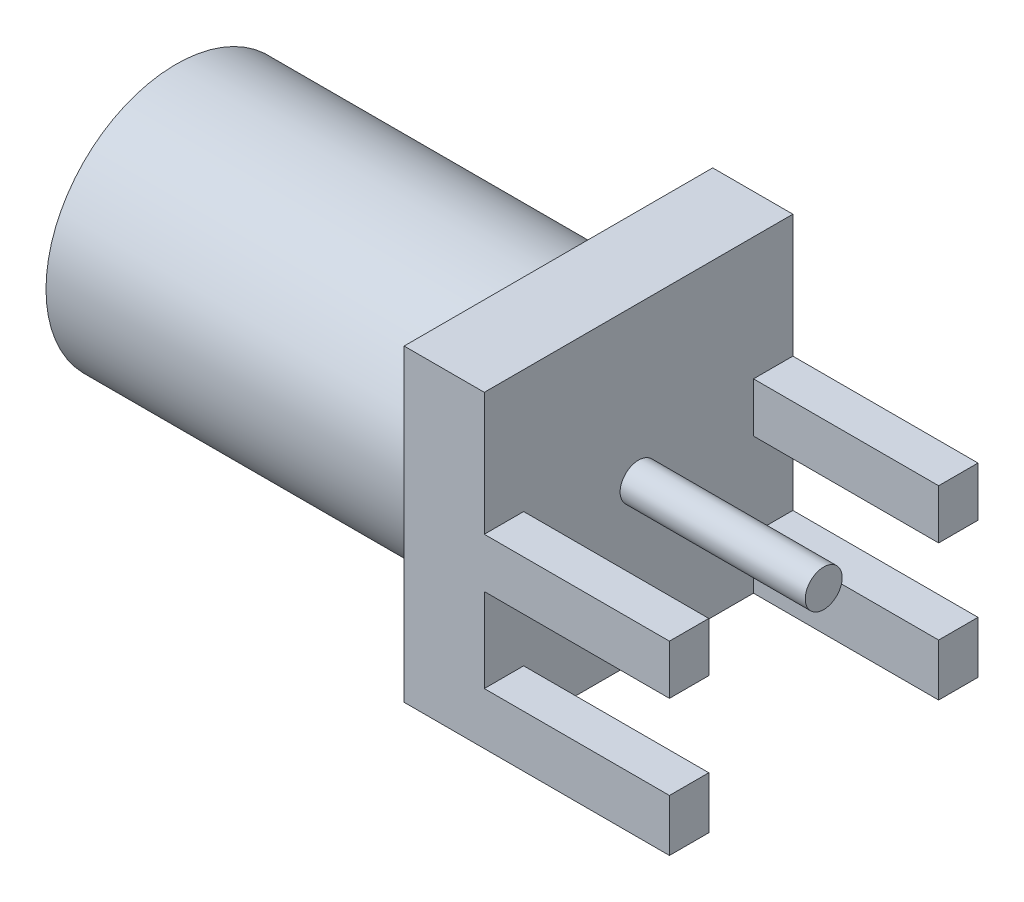
ISO-10303-21;
HEADER;
FILE_DESCRIPTION(('STEP AP214'),'2;1');
FILE_NAME('part.step','',(''),(''),'','','');
FILE_SCHEMA(('AUTOMOTIVE_DESIGN { 1 0 10303 214 1 1 1 1 }'));
ENDSEC;
DATA;
#1=APPLICATION_CONTEXT('core data for automotive mechanical design processes');
#2=APPLICATION_PROTOCOL_DEFINITION('international standard','automotive_design',2000,#1);
#3=PRODUCT_CONTEXT('',#1,'mechanical');
#4=PRODUCT('Part','Part','',(#3));
#5=PRODUCT_RELATED_PRODUCT_CATEGORY('part','',(#4));
#6=PRODUCT_DEFINITION_FORMATION('','',#4);
#7=PRODUCT_DEFINITION_CONTEXT('part definition',#1,'design');
#8=PRODUCT_DEFINITION('design','',#6,#7);
#9=PRODUCT_DEFINITION_SHAPE('','',#8);
#10=(LENGTH_UNIT() NAMED_UNIT(*) SI_UNIT(.MILLI.,.METRE.));
#11=(NAMED_UNIT(*) PLANE_ANGLE_UNIT() SI_UNIT($,.RADIAN.));
#12=(NAMED_UNIT(*) SI_UNIT($,.STERADIAN.) SOLID_ANGLE_UNIT());
#13=UNCERTAINTY_MEASURE_WITH_UNIT(LENGTH_MEASURE(1.E-05),#10,'distance_accuracy_value','');
#14=(GEOMETRIC_REPRESENTATION_CONTEXT(3) GLOBAL_UNCERTAINTY_ASSIGNED_CONTEXT((#13)) GLOBAL_UNIT_ASSIGNED_CONTEXT((#10,
#11,#12)) REPRESENTATION_CONTEXT('',''));
#15=CARTESIAN_POINT('',(0.,0.,0.));
#16=DIRECTION('',(0.,0.,1.));
#17=DIRECTION('',(1.,0.,0.));
#18=AXIS2_PLACEMENT_3D('',#15,#16,#17);
#19=CARTESIAN_POINT('',(-1.65,0.,0.));
#20=DIRECTION('',(-1.,0.,0.));
#21=DIRECTION('',(0.,0.,1.));
#22=AXIS2_PLACEMENT_3D('',#19,#20,#21);
#23=PLANE('',#22);
#24=DIRECTION('',(0.,1.,0.));
#25=VECTOR('',#24,1.);
#26=CARTESIAN_POINT('',(-1.65,-3.175,-3.175));
#27=LINE('',#26,#25);
#28=CARTESIAN_POINT('',(-1.65,-3.175,-3.175));
#29=VERTEX_POINT('',#28);
#30=CARTESIAN_POINT('',(-1.65,3.175,-3.175));
#31=VERTEX_POINT('',#30);
#32=EDGE_CURVE('E273',#29,#31,#27,.T.);
#33=ORIENTED_EDGE('',*,*,#32,.F.);
#34=DIRECTION('',(0.,0.,-1.));
#35=VECTOR('',#34,1.);
#36=CARTESIAN_POINT('',(-1.65,-3.175,3.175));
#37=LINE('',#36,#35);
#38=CARTESIAN_POINT('',(-1.65,-3.175,3.175));
#39=VERTEX_POINT('',#38);
#40=EDGE_CURVE('E296',#39,#29,#37,.T.);
#41=ORIENTED_EDGE('',*,*,#40,.F.);
#42=DIRECTION('',(0.,-1.,0.));
#43=VECTOR('',#42,1.);
#44=CARTESIAN_POINT('',(-1.65,-3.175,3.175));
#45=LINE('',#44,#43);
#46=CARTESIAN_POINT('',(-1.65,3.175,3.175));
#47=VERTEX_POINT('',#46);
#48=EDGE_CURVE('E370',#47,#39,#45,.T.);
#49=ORIENTED_EDGE('',*,*,#48,.F.);
#50=DIRECTION('',(0.,0.,1.));
#51=VECTOR('',#50,1.);
#52=CARTESIAN_POINT('',(-1.65,3.175,3.175));
#53=LINE('',#52,#51);
#54=EDGE_CURVE('E372',#31,#47,#53,.T.);
#55=ORIENTED_EDGE('',*,*,#54,.F.);
#56=EDGE_LOOP('',(#33,#41,#49,#55));
#57=FACE_BOUND('',#56,.T.);
#58=CARTESIAN_POINT('',(-1.65,0.,0.));
#59=DIRECTION('',(-1.,0.,0.));
#60=DIRECTION('',(0.,0.,1.));
#61=AXIS2_PLACEMENT_3D('',#58,#59,#60);
#62=CIRCLE('',#61,2.675);
#63=CARTESIAN_POINT('',(-1.65,0.,2.675));
#64=VERTEX_POINT('',#63);
#65=EDGE_CURVE('E551',#64,#64,#62,.T.);
#66=ORIENTED_EDGE('',*,*,#65,.F.);
#67=EDGE_LOOP('',(#66));
#68=FACE_BOUND('',#67,.T.);
#69=ADVANCED_FACE('F37',(#57,#68),#23,.T.);
#70=CARTESIAN_POINT('',(0.,0.,0.));
#71=DIRECTION('',(-1.,0.,0.));
#72=DIRECTION('',(0.,0.,1.));
#73=AXIS2_PLACEMENT_3D('',#70,#71,#72);
#74=PLANE('',#73);
#75=DIRECTION('',(0.,0.,1.));
#76=VECTOR('',#75,1.);
#77=CARTESIAN_POINT('',(0.,0.644999999999998,2.365));
#78=LINE('',#77,#76);
#79=CARTESIAN_POINT('',(0.,0.644999999999998,2.365));
#80=VERTEX_POINT('',#79);
#81=CARTESIAN_POINT('',(0.,0.644999999999998,3.175));
#82=VERTEX_POINT('',#81);
#83=EDGE_CURVE('E57',#80,#82,#78,.T.);
#84=ORIENTED_EDGE('',*,*,#83,.F.);
#85=DIRECTION('',(0.,1.,0.));
#86=VECTOR('',#85,1.);
#87=CARTESIAN_POINT('',(0.,0.644999999999998,2.365));
#88=LINE('',#87,#86);
#89=CARTESIAN_POINT('',(0.,-0.375000000000002,2.365));
#90=VERTEX_POINT('',#89);
#91=EDGE_CURVE('E52',#90,#80,#88,.T.);
#92=ORIENTED_EDGE('',*,*,#91,.F.);
#93=DIRECTION('',(0.,0.,1.));
#94=VECTOR('',#93,1.);
#95=CARTESIAN_POINT('',(0.,-0.375000000000002,2.365));
#96=LINE('',#95,#94);
#97=CARTESIAN_POINT('',(0.,-0.375000000000002,3.175));
#98=VERTEX_POINT('',#97);
#99=EDGE_CURVE('E181',#90,#98,#96,.T.);
#100=ORIENTED_EDGE('',*,*,#99,.T.);
#101=DIRECTION('',(0.,-1.,0.));
#102=VECTOR('',#101,1.);
#103=CARTESIAN_POINT('',(0.,-3.175,3.175));
#104=LINE('',#103,#102);
#105=CARTESIAN_POINT('',(0.,-2.105,3.175));
#106=VERTEX_POINT('',#105);
#107=EDGE_CURVE('E360',#98,#106,#104,.T.);
#108=ORIENTED_EDGE('',*,*,#107,.T.);
#109=DIRECTION('',(0.,0.,1.));
#110=VECTOR('',#109,1.);
#111=CARTESIAN_POINT('',(0.,-2.105,2.365));
#112=LINE('',#111,#110);
#113=CARTESIAN_POINT('',(0.,-2.105,2.365));
#114=VERTEX_POINT('',#113);
#115=EDGE_CURVE('E214',#114,#106,#112,.T.);
#116=ORIENTED_EDGE('',*,*,#115,.F.);
#117=DIRECTION('',(0.,1.,0.));
#118=VECTOR('',#117,1.);
#119=CARTESIAN_POINT('',(0.,-2.105,2.365));
#120=LINE('',#119,#118);
#121=CARTESIAN_POINT('',(0.,-3.175,2.365));
#122=VERTEX_POINT('',#121);
#123=EDGE_CURVE('E199',#122,#114,#120,.T.);
#124=ORIENTED_EDGE('',*,*,#123,.F.);
#125=DIRECTION('',(0.,0.,-1.));
#126=VECTOR('',#125,1.);
#127=CARTESIAN_POINT('',(0.,-3.175,3.175));
#128=LINE('',#127,#126);
#129=CARTESIAN_POINT('',(0.,-3.175,-2.365));
#130=VERTEX_POINT('',#129);
#131=EDGE_CURVE('E291',#122,#130,#128,.T.);
#132=ORIENTED_EDGE('',*,*,#131,.T.);
#133=DIRECTION('',(0.,1.,0.));
#134=VECTOR('',#133,1.);
#135=CARTESIAN_POINT('',(0.,-2.105,-2.365));
#136=LINE('',#135,#134);
#137=CARTESIAN_POINT('',(0.,-2.105,-2.365));
#138=VERTEX_POINT('',#137);
#139=EDGE_CURVE('E257',#130,#138,#136,.T.);
#140=ORIENTED_EDGE('',*,*,#139,.T.);
#141=DIRECTION('',(0.,0.,-1.));
#142=VECTOR('',#141,1.);
#143=CARTESIAN_POINT('',(0.,-2.105,-2.365));
#144=LINE('',#143,#142);
#145=CARTESIAN_POINT('',(0.,-2.105,-3.175));
#146=VERTEX_POINT('',#145);
#147=EDGE_CURVE('E270',#138,#146,#144,.T.);
#148=ORIENTED_EDGE('',*,*,#147,.T.);
#149=DIRECTION('',(0.,1.,0.));
#150=VECTOR('',#149,1.);
#151=CARTESIAN_POINT('',(0.,-3.175,-3.175));
#152=LINE('',#151,#150);
#153=CARTESIAN_POINT('',(0.,-0.375000000000002,-3.175));
#154=VERTEX_POINT('',#153);
#155=EDGE_CURVE('E290',#146,#154,#152,.T.);
#156=ORIENTED_EDGE('',*,*,#155,.T.);
#157=DIRECTION('',(0.,0.,-1.));
#158=VECTOR('',#157,1.);
#159=CARTESIAN_POINT('',(0.,-0.375000000000002,-2.365));
#160=LINE('',#159,#158);
#161=CARTESIAN_POINT('',(0.,-0.375000000000002,-2.365));
#162=VERTEX_POINT('',#161);
#163=EDGE_CURVE('E243',#162,#154,#160,.T.);
#164=ORIENTED_EDGE('',*,*,#163,.F.);
#165=DIRECTION('',(0.,1.,0.));
#166=VECTOR('',#165,1.);
#167=CARTESIAN_POINT('',(0.,0.644999999999998,-2.365));
#168=LINE('',#167,#166);
#169=CARTESIAN_POINT('',(0.,0.644999999999998,-2.365));
#170=VERTEX_POINT('',#169);
#171=EDGE_CURVE('E223',#162,#170,#168,.T.);
#172=ORIENTED_EDGE('',*,*,#171,.T.);
#173=DIRECTION('',(0.,0.,-1.));
#174=VECTOR('',#173,1.);
#175=CARTESIAN_POINT('',(0.,0.644999999999998,-2.365));
#176=LINE('',#175,#174);
#177=CARTESIAN_POINT('',(0.,0.644999999999998,-3.175));
#178=VERTEX_POINT('',#177);
#179=EDGE_CURVE('E235',#170,#178,#176,.T.);
#180=ORIENTED_EDGE('',*,*,#179,.T.);
#181=CARTESIAN_POINT('',(0.,3.175,-3.175));
#182=VERTEX_POINT('',#181);
#183=EDGE_CURVE('E267',#178,#182,#152,.T.);
#184=ORIENTED_EDGE('',*,*,#183,.T.);
#185=DIRECTION('',(0.,0.,1.));
#186=VECTOR('',#185,1.);
#187=CARTESIAN_POINT('',(0.,3.175,3.175));
#188=LINE('',#187,#186);
#189=CARTESIAN_POINT('',(0.,3.175,3.175));
#190=VERTEX_POINT('',#189);
#191=EDGE_CURVE('E298',#182,#190,#188,.T.);
#192=ORIENTED_EDGE('',*,*,#191,.T.);
#193=EDGE_CURVE('E355',#190,#82,#104,.T.);
#194=ORIENTED_EDGE('',*,*,#193,.T.);
#195=EDGE_LOOP('',(#84,#92,#100,#108,#116,#124,#132,#140,#148,#156,#164,#172,#180,#184,#192,#194));
#196=FACE_BOUND('',#195,.T.);
#197=CARTESIAN_POINT('',(0.,0.,0.));
#198=DIRECTION('',(-1.,0.,0.));
#199=DIRECTION('',(0.,0.,1.));
#200=AXIS2_PLACEMENT_3D('',#197,#198,#199);
#201=CIRCLE('',#200,0.38);
#202=CARTESIAN_POINT('',(0.,0.,0.38));
#203=VERTEX_POINT('',#202);
#204=EDGE_CURVE('E12',#203,#203,#201,.F.);
#205=ORIENTED_EDGE('',*,*,#204,.F.);
#206=EDGE_LOOP('',(#205));
#207=FACE_BOUND('',#206,.T.);
#208=ADVANCED_FACE('F312',(#196,#207),#74,.F.);
#209=CARTESIAN_POINT('',(-1.65,-3.175,-3.175));
#210=DIRECTION('',(0.,0.,-1.));
#211=DIRECTION('',(-1.,0.,0.));
#212=AXIS2_PLACEMENT_3D('',#209,#210,#211);
#213=PLANE('',#212);
#214=ORIENTED_EDGE('',*,*,#155,.F.);
#215=DIRECTION('',(1.,0.,0.));
#216=VECTOR('',#215,1.);
#217=CARTESIAN_POINT('',(3.81,-2.105,-3.175));
#218=LINE('',#217,#216);
#219=CARTESIAN_POINT('',(3.81,-2.105,-3.175));
#220=VERTEX_POINT('',#219);
#221=EDGE_CURVE('E246',#146,#220,#218,.T.);
#222=ORIENTED_EDGE('',*,*,#221,.T.);
#223=DIRECTION('',(0.,-1.,0.));
#224=VECTOR('',#223,1.);
#225=CARTESIAN_POINT('',(3.81,-3.175,-3.175));
#226=LINE('',#225,#224);
#227=CARTESIAN_POINT('',(3.81,-3.175,-3.175));
#228=VERTEX_POINT('',#227);
#229=EDGE_CURVE('E261',#220,#228,#226,.T.);
#230=ORIENTED_EDGE('',*,*,#229,.T.);
#231=DIRECTION('',(1.,0.,0.));
#232=VECTOR('',#231,1.);
#233=CARTESIAN_POINT('',(-1.65,-3.175,-3.175));
#234=LINE('',#233,#232);
#235=EDGE_CURVE('E45',#29,#228,#234,.T.);
#236=ORIENTED_EDGE('',*,*,#235,.F.);
#237=ORIENTED_EDGE('',*,*,#32,.T.);
#238=DIRECTION('',(1.,0.,0.));
#239=VECTOR('',#238,1.);
#240=CARTESIAN_POINT('',(-1.65,3.175,-3.175));
#241=LINE('',#240,#239);
#242=EDGE_CURVE('E303',#31,#182,#241,.T.);
#243=ORIENTED_EDGE('',*,*,#242,.T.);
#244=ORIENTED_EDGE('',*,*,#183,.F.);
#245=DIRECTION('',(1.,0.,0.));
#246=VECTOR('',#245,1.);
#247=CARTESIAN_POINT('',(3.81,0.644999999999998,-3.175));
#248=LINE('',#247,#246);
#249=CARTESIAN_POINT('',(3.81,0.644999999999998,-3.175));
#250=VERTEX_POINT('',#249);
#251=EDGE_CURVE('E217',#178,#250,#248,.T.);
#252=ORIENTED_EDGE('',*,*,#251,.T.);
#253=DIRECTION('',(0.,-1.,0.));
#254=VECTOR('',#253,1.);
#255=CARTESIAN_POINT('',(3.81,-0.375000000000002,-3.175));
#256=LINE('',#255,#254);
#257=CARTESIAN_POINT('',(3.81,-0.375000000000002,-3.175));
#258=VERTEX_POINT('',#257);
#259=EDGE_CURVE('E238',#250,#258,#256,.T.);
#260=ORIENTED_EDGE('',*,*,#259,.T.);
#261=DIRECTION('',(-1.,0.,0.));
#262=VECTOR('',#261,1.);
#263=CARTESIAN_POINT('',(0.,-0.375000000000002,-3.175));
#264=LINE('',#263,#262);
#265=EDGE_CURVE('E226',#258,#154,#264,.T.);
#266=ORIENTED_EDGE('',*,*,#265,.T.);
#267=EDGE_LOOP('',(#214,#222,#230,#236,#237,#243,#244,#252,#260,#266));
#268=FACE_BOUND('',#267,.T.);
#269=ADVANCED_FACE('F39',(#268),#213,.T.);
#270=CARTESIAN_POINT('',(-1.65,-3.175,3.175));
#271=DIRECTION('',(0.,-1.,0.));
#272=DIRECTION('',(0.,0.,-1.));
#273=AXIS2_PLACEMENT_3D('',#270,#271,#272);
#274=PLANE('',#273);
#275=ORIENTED_EDGE('',*,*,#131,.F.);
#276=DIRECTION('',(-1.,0.,0.));
#277=VECTOR('',#276,1.);
#278=CARTESIAN_POINT('',(0.,-3.175,2.365));
#279=LINE('',#278,#277);
#280=CARTESIAN_POINT('',(3.81,-3.175,2.365));
#281=VERTEX_POINT('',#280);
#282=EDGE_CURVE('E202',#281,#122,#279,.T.);
#283=ORIENTED_EDGE('',*,*,#282,.F.);
#284=DIRECTION('',(0.,0.,1.));
#285=VECTOR('',#284,1.);
#286=CARTESIAN_POINT('',(3.81,-3.175,2.365));
#287=LINE('',#286,#285);
#288=CARTESIAN_POINT('',(3.81,-3.175,3.175));
#289=VERTEX_POINT('',#288);
#290=EDGE_CURVE('E210',#281,#289,#287,.T.);
#291=ORIENTED_EDGE('',*,*,#290,.T.);
#292=DIRECTION('',(1.,0.,0.));
#293=VECTOR('',#292,1.);
#294=CARTESIAN_POINT('',(-1.65,-3.175,3.175));
#295=LINE('',#294,#293);
#296=EDGE_CURVE('E367',#39,#289,#295,.T.);
#297=ORIENTED_EDGE('',*,*,#296,.F.);
#298=ORIENTED_EDGE('',*,*,#40,.T.);
#299=ORIENTED_EDGE('',*,*,#235,.T.);
#300=DIRECTION('',(0.,0.,-1.));
#301=VECTOR('',#300,1.);
#302=CARTESIAN_POINT('',(3.81,-3.175,-2.365));
#303=LINE('',#302,#301);
#304=CARTESIAN_POINT('',(3.81,-3.175,-2.365));
#305=VERTEX_POINT('',#304);
#306=EDGE_CURVE('E264',#305,#228,#303,.T.);
#307=ORIENTED_EDGE('',*,*,#306,.F.);
#308=DIRECTION('',(-1.,0.,0.));
#309=VECTOR('',#308,1.);
#310=CARTESIAN_POINT('',(0.,-3.175,-2.365));
#311=LINE('',#310,#309);
#312=EDGE_CURVE('E260',#305,#130,#311,.T.);
#313=ORIENTED_EDGE('',*,*,#312,.T.);
#314=EDGE_LOOP('',(#275,#283,#291,#297,#298,#299,#307,#313));
#315=FACE_BOUND('',#314,.T.);
#316=ADVANCED_FACE('F321',(#315),#274,.T.);
#317=CARTESIAN_POINT('',(-1.65,-3.175,3.175));
#318=DIRECTION('',(0.,0.,1.));
#319=DIRECTION('',(1.,0.,0.));
#320=AXIS2_PLACEMENT_3D('',#317,#318,#319);
#321=PLANE('',#320);
#322=ORIENTED_EDGE('',*,*,#193,.F.);
#323=DIRECTION('',(1.,0.,0.));
#324=VECTOR('',#323,1.);
#325=CARTESIAN_POINT('',(-1.65,3.175,3.175));
#326=LINE('',#325,#324);
#327=EDGE_CURVE('E358',#47,#190,#326,.T.);
#328=ORIENTED_EDGE('',*,*,#327,.F.);
#329=ORIENTED_EDGE('',*,*,#48,.T.);
#330=ORIENTED_EDGE('',*,*,#296,.T.);
#331=DIRECTION('',(0.,-1.,0.));
#332=VECTOR('',#331,1.);
#333=CARTESIAN_POINT('',(3.81,-3.175,3.175));
#334=LINE('',#333,#332);
#335=CARTESIAN_POINT('',(3.81,-2.105,3.175));
#336=VERTEX_POINT('',#335);
#337=EDGE_CURVE('E196',#336,#289,#334,.T.);
#338=ORIENTED_EDGE('',*,*,#337,.F.);
#339=DIRECTION('',(1.,0.,0.));
#340=VECTOR('',#339,1.);
#341=CARTESIAN_POINT('',(3.81,-2.105,3.175));
#342=LINE('',#341,#340);
#343=EDGE_CURVE('E203',#106,#336,#342,.T.);
#344=ORIENTED_EDGE('',*,*,#343,.F.);
#345=ORIENTED_EDGE('',*,*,#107,.F.);
#346=DIRECTION('',(-1.,0.,0.));
#347=VECTOR('',#346,1.);
#348=CARTESIAN_POINT('',(0.,-0.375000000000002,3.175));
#349=LINE('',#348,#347);
#350=CARTESIAN_POINT('',(3.81,-0.375000000000002,3.175));
#351=VERTEX_POINT('',#350);
#352=EDGE_CURVE('E190',#351,#98,#349,.T.);
#353=ORIENTED_EDGE('',*,*,#352,.F.);
#354=DIRECTION('',(0.,-1.,0.));
#355=VECTOR('',#354,1.);
#356=CARTESIAN_POINT('',(3.81,-0.375000000000002,3.175));
#357=LINE('',#356,#355);
#358=CARTESIAN_POINT('',(3.81,0.644999999999998,3.175));
#359=VERTEX_POINT('',#358);
#360=EDGE_CURVE('E176',#359,#351,#357,.T.);
#361=ORIENTED_EDGE('',*,*,#360,.F.);
#362=DIRECTION('',(1.,0.,0.));
#363=VECTOR('',#362,1.);
#364=CARTESIAN_POINT('',(3.81,0.644999999999998,3.175));
#365=LINE('',#364,#363);
#366=EDGE_CURVE('E185',#82,#359,#365,.T.);
#367=ORIENTED_EDGE('',*,*,#366,.F.);
#368=EDGE_LOOP('',(#322,#328,#329,#330,#338,#344,#345,#353,#361,#367));
#369=FACE_BOUND('',#368,.T.);
#370=ADVANCED_FACE('F334',(#369),#321,.T.);
#371=CARTESIAN_POINT('',(-1.65,3.175,3.175));
#372=DIRECTION('',(0.,1.,0.));
#373=DIRECTION('',(0.,0.,1.));
#374=AXIS2_PLACEMENT_3D('',#371,#372,#373);
#375=PLANE('',#374);
#376=ORIENTED_EDGE('',*,*,#191,.F.);
#377=ORIENTED_EDGE('',*,*,#242,.F.);
#378=ORIENTED_EDGE('',*,*,#54,.T.);
#379=ORIENTED_EDGE('',*,*,#327,.T.);
#380=EDGE_LOOP('',(#376,#377,#378,#379));
#381=FACE_BOUND('',#380,.T.);
#382=ADVANCED_FACE('F327',(#381),#375,.T.);
#383=CARTESIAN_POINT('',(3.81,-3.175,-2.365));
#384=DIRECTION('',(1.,0.,0.));
#385=DIRECTION('',(0.,0.,-1.));
#386=AXIS2_PLACEMENT_3D('',#383,#384,#385);
#387=PLANE('',#386);
#388=ORIENTED_EDGE('',*,*,#229,.F.);
#389=DIRECTION('',(0.,0.,-1.));
#390=VECTOR('',#389,1.);
#391=CARTESIAN_POINT('',(3.81,-2.105,-2.365));
#392=LINE('',#391,#390);
#393=CARTESIAN_POINT('',(3.81,-2.105,-2.365));
#394=VERTEX_POINT('',#393);
#395=EDGE_CURVE('E268',#394,#220,#392,.T.);
#396=ORIENTED_EDGE('',*,*,#395,.F.);
#397=DIRECTION('',(0.,-1.,0.));
#398=VECTOR('',#397,1.);
#399=CARTESIAN_POINT('',(3.81,-3.175,-2.365));
#400=LINE('',#399,#398);
#401=EDGE_CURVE('E256',#394,#305,#400,.T.);
#402=ORIENTED_EDGE('',*,*,#401,.T.);
#403=ORIENTED_EDGE('',*,*,#306,.T.);
#404=EDGE_LOOP('',(#388,#396,#402,#403));
#405=FACE_BOUND('',#404,.T.);
#406=ADVANCED_FACE('F325',(#405),#387,.T.);
#407=CARTESIAN_POINT('',(3.81,-2.105,-2.365));
#408=DIRECTION('',(0.,1.,0.));
#409=DIRECTION('',(0.,0.,1.));
#410=AXIS2_PLACEMENT_3D('',#407,#408,#409);
#411=PLANE('',#410);
#412=ORIENTED_EDGE('',*,*,#221,.F.);
#413=ORIENTED_EDGE('',*,*,#147,.F.);
#414=DIRECTION('',(1.,0.,0.));
#415=VECTOR('',#414,1.);
#416=CARTESIAN_POINT('',(3.81,-2.105,-2.365));
#417=LINE('',#416,#415);
#418=EDGE_CURVE('E253',#138,#394,#417,.T.);
#419=ORIENTED_EDGE('',*,*,#418,.T.);
#420=ORIENTED_EDGE('',*,*,#395,.T.);
#421=EDGE_LOOP('',(#412,#413,#419,#420));
#422=FACE_BOUND('',#421,.T.);
#423=ADVANCED_FACE('F310',(#422),#411,.T.);
#424=CARTESIAN_POINT('',(0.,0.,-2.365));
#425=DIRECTION('',(0.,0.,1.));
#426=DIRECTION('',(1.,0.,0.));
#427=AXIS2_PLACEMENT_3D('',#424,#425,#426);
#428=PLANE('',#427);
#429=ORIENTED_EDGE('',*,*,#139,.F.);
#430=ORIENTED_EDGE('',*,*,#312,.F.);
#431=ORIENTED_EDGE('',*,*,#401,.F.);
#432=ORIENTED_EDGE('',*,*,#418,.F.);
#433=EDGE_LOOP('',(#429,#430,#431,#432));
#434=FACE_BOUND('',#433,.T.);
#435=ADVANCED_FACE('F318',(#434),#428,.T.);
#436=CARTESIAN_POINT('',(0.,-0.375000000000002,-2.365));
#437=DIRECTION('',(0.,-1.,0.));
#438=DIRECTION('',(1.,0.,0.));
#439=AXIS2_PLACEMENT_3D('',#436,#437,#438);
#440=PLANE('',#439);
#441=ORIENTED_EDGE('',*,*,#265,.F.);
#442=DIRECTION('',(0.,0.,-1.));
#443=VECTOR('',#442,1.);
#444=CARTESIAN_POINT('',(3.81,-0.375000000000002,-2.365));
#445=LINE('',#444,#443);
#446=CARTESIAN_POINT('',(3.81,-0.375000000000002,-2.365));
#447=VERTEX_POINT('',#446);
#448=EDGE_CURVE('E247',#447,#258,#445,.T.);
#449=ORIENTED_EDGE('',*,*,#448,.F.);
#450=DIRECTION('',(-1.,0.,0.));
#451=VECTOR('',#450,1.);
#452=CARTESIAN_POINT('',(0.,-0.375000000000002,-2.365));
#453=LINE('',#452,#451);
#454=EDGE_CURVE('E232',#447,#162,#453,.T.);
#455=ORIENTED_EDGE('',*,*,#454,.T.);
#456=ORIENTED_EDGE('',*,*,#163,.T.);
#457=EDGE_LOOP('',(#441,#449,#455,#456));
#458=FACE_BOUND('',#457,.T.);
#459=ADVANCED_FACE('F399',(#458),#440,.T.);
#460=CARTESIAN_POINT('',(3.81,-0.375000000000002,-2.365));
#461=DIRECTION('',(1.,0.,0.));
#462=DIRECTION('',(0.,0.,-1.));
#463=AXIS2_PLACEMENT_3D('',#460,#461,#462);
#464=PLANE('',#463);
#465=ORIENTED_EDGE('',*,*,#259,.F.);
#466=DIRECTION('',(0.,0.,-1.));
#467=VECTOR('',#466,1.);
#468=CARTESIAN_POINT('',(3.81,0.644999999999998,-2.365));
#469=LINE('',#468,#467);
#470=CARTESIAN_POINT('',(3.81,0.644999999999998,-2.365));
#471=VERTEX_POINT('',#470);
#472=EDGE_CURVE('E249',#471,#250,#469,.T.);
#473=ORIENTED_EDGE('',*,*,#472,.F.);
#474=DIRECTION('',(0.,-1.,0.));
#475=VECTOR('',#474,1.);
#476=CARTESIAN_POINT('',(3.81,-0.375000000000002,-2.365));
#477=LINE('',#476,#475);
#478=EDGE_CURVE('E229',#471,#447,#477,.T.);
#479=ORIENTED_EDGE('',*,*,#478,.T.);
#480=ORIENTED_EDGE('',*,*,#448,.T.);
#481=EDGE_LOOP('',(#465,#473,#479,#480));
#482=FACE_BOUND('',#481,.T.);
#483=ADVANCED_FACE('F402',(#482),#464,.T.);
#484=CARTESIAN_POINT('',(3.81,0.644999999999998,-2.365));
#485=DIRECTION('',(0.,1.,0.));
#486=DIRECTION('',(-1.,0.,0.));
#487=AXIS2_PLACEMENT_3D('',#484,#485,#486);
#488=PLANE('',#487);
#489=ORIENTED_EDGE('',*,*,#251,.F.);
#490=ORIENTED_EDGE('',*,*,#179,.F.);
#491=DIRECTION('',(1.,0.,0.));
#492=VECTOR('',#491,1.);
#493=CARTESIAN_POINT('',(3.81,0.644999999999998,-2.365));
#494=LINE('',#493,#492);
#495=EDGE_CURVE('E225',#170,#471,#494,.T.);
#496=ORIENTED_EDGE('',*,*,#495,.T.);
#497=ORIENTED_EDGE('',*,*,#472,.T.);
#498=EDGE_LOOP('',(#489,#490,#496,#497));
#499=FACE_BOUND('',#498,.T.);
#500=ADVANCED_FACE('F393',(#499),#488,.T.);
#501=CARTESIAN_POINT('',(0.,0.,-2.365));
#502=DIRECTION('',(0.,0.,1.));
#503=DIRECTION('',(1.,0.,0.));
#504=AXIS2_PLACEMENT_3D('',#501,#502,#503);
#505=PLANE('',#504);
#506=ORIENTED_EDGE('',*,*,#171,.F.);
#507=ORIENTED_EDGE('',*,*,#454,.F.);
#508=ORIENTED_EDGE('',*,*,#478,.F.);
#509=ORIENTED_EDGE('',*,*,#495,.F.);
#510=EDGE_LOOP('',(#506,#507,#508,#509));
#511=FACE_BOUND('',#510,.T.);
#512=ADVANCED_FACE('F386',(#511),#505,.T.);
#513=CARTESIAN_POINT('',(3.81,-2.105,2.365));
#514=DIRECTION('',(0.,-1.,0.));
#515=DIRECTION('',(0.,0.,-1.));
#516=AXIS2_PLACEMENT_3D('',#513,#514,#515);
#517=PLANE('',#516);
#518=ORIENTED_EDGE('',*,*,#343,.T.);
#519=DIRECTION('',(0.,0.,1.));
#520=VECTOR('',#519,1.);
#521=CARTESIAN_POINT('',(3.81,-2.105,2.365));
#522=LINE('',#521,#520);
#523=CARTESIAN_POINT('',(3.81,-2.105,2.365));
#524=VERTEX_POINT('',#523);
#525=EDGE_CURVE('E218',#524,#336,#522,.T.);
#526=ORIENTED_EDGE('',*,*,#525,.F.);
#527=DIRECTION('',(1.,0.,0.));
#528=VECTOR('',#527,1.);
#529=CARTESIAN_POINT('',(3.81,-2.105,2.365));
#530=LINE('',#529,#528);
#531=EDGE_CURVE('E208',#114,#524,#530,.T.);
#532=ORIENTED_EDGE('',*,*,#531,.F.);
#533=ORIENTED_EDGE('',*,*,#115,.T.);
#534=EDGE_LOOP('',(#518,#526,#532,#533));
#535=FACE_BOUND('',#534,.T.);
#536=ADVANCED_FACE('F384',(#535),#517,.F.);
#537=CARTESIAN_POINT('',(3.81,-3.175,2.365));
#538=DIRECTION('',(-1.,0.,0.));
#539=DIRECTION('',(0.,0.,1.));
#540=AXIS2_PLACEMENT_3D('',#537,#538,#539);
#541=PLANE('',#540);
#542=ORIENTED_EDGE('',*,*,#337,.T.);
#543=ORIENTED_EDGE('',*,*,#290,.F.);
#544=DIRECTION('',(0.,-1.,0.));
#545=VECTOR('',#544,1.);
#546=CARTESIAN_POINT('',(3.81,-3.175,2.365));
#547=LINE('',#546,#545);
#548=EDGE_CURVE('E206',#524,#281,#547,.T.);
#549=ORIENTED_EDGE('',*,*,#548,.F.);
#550=ORIENTED_EDGE('',*,*,#525,.T.);
#551=EDGE_LOOP('',(#542,#543,#549,#550));
#552=FACE_BOUND('',#551,.T.);
#553=ADVANCED_FACE('F377',(#552),#541,.F.);
#554=CARTESIAN_POINT('',(0.,0.,2.365));
#555=DIRECTION('',(0.,0.,-1.));
#556=DIRECTION('',(1.,0.,0.));
#557=AXIS2_PLACEMENT_3D('',#554,#555,#556);
#558=PLANE('',#557);
#559=ORIENTED_EDGE('',*,*,#123,.T.);
#560=ORIENTED_EDGE('',*,*,#531,.T.);
#561=ORIENTED_EDGE('',*,*,#548,.T.);
#562=ORIENTED_EDGE('',*,*,#282,.T.);
#563=EDGE_LOOP('',(#559,#560,#561,#562));
#564=FACE_BOUND('',#563,.T.);
#565=ADVANCED_FACE('F381',(#564),#558,.T.);
#566=CARTESIAN_POINT('',(3.81,0.644999999999998,2.365));
#567=DIRECTION('',(0.,-1.,0.));
#568=DIRECTION('',(1.,0.,0.));
#569=AXIS2_PLACEMENT_3D('',#566,#567,#568);
#570=PLANE('',#569);
#571=ORIENTED_EDGE('',*,*,#366,.T.);
#572=DIRECTION('',(0.,0.,1.));
#573=VECTOR('',#572,1.);
#574=CARTESIAN_POINT('',(3.81,0.644999999999998,2.365));
#575=LINE('',#574,#573);
#576=CARTESIAN_POINT('',(3.81,0.644999999999998,2.365));
#577=VERTEX_POINT('',#576);
#578=EDGE_CURVE('E180',#577,#359,#575,.T.);
#579=ORIENTED_EDGE('',*,*,#578,.F.);
#580=DIRECTION('',(1.,0.,0.));
#581=VECTOR('',#580,1.);
#582=CARTESIAN_POINT('',(3.81,0.644999999999998,2.365));
#583=LINE('',#582,#581);
#584=EDGE_CURVE('E167',#80,#577,#583,.T.);
#585=ORIENTED_EDGE('',*,*,#584,.F.);
#586=ORIENTED_EDGE('',*,*,#83,.T.);
#587=EDGE_LOOP('',(#571,#579,#585,#586));
#588=FACE_BOUND('',#587,.T.);
#589=ADVANCED_FACE('F462',(#588),#570,.F.);
#590=CARTESIAN_POINT('',(3.81,-0.375000000000002,2.365));
#591=DIRECTION('',(-1.,0.,0.));
#592=DIRECTION('',(0.,0.,1.));
#593=AXIS2_PLACEMENT_3D('',#590,#591,#592);
#594=PLANE('',#593);
#595=ORIENTED_EDGE('',*,*,#360,.T.);
#596=DIRECTION('',(0.,0.,1.));
#597=VECTOR('',#596,1.);
#598=CARTESIAN_POINT('',(3.81,-0.375000000000002,2.365));
#599=LINE('',#598,#597);
#600=CARTESIAN_POINT('',(3.81,-0.375000000000002,2.365));
#601=VERTEX_POINT('',#600);
#602=EDGE_CURVE('E173',#601,#351,#599,.T.);
#603=ORIENTED_EDGE('',*,*,#602,.F.);
#604=DIRECTION('',(0.,-1.,0.));
#605=VECTOR('',#604,1.);
#606=CARTESIAN_POINT('',(3.81,-0.375000000000002,2.365));
#607=LINE('',#606,#605);
#608=EDGE_CURVE('E161',#577,#601,#607,.T.);
#609=ORIENTED_EDGE('',*,*,#608,.F.);
#610=ORIENTED_EDGE('',*,*,#578,.T.);
#611=EDGE_LOOP('',(#595,#603,#609,#610));
#612=FACE_BOUND('',#611,.T.);
#613=ADVANCED_FACE('F174',(#612),#594,.F.);
#614=CARTESIAN_POINT('',(0.,-0.375000000000002,2.365));
#615=DIRECTION('',(0.,1.,0.));
#616=DIRECTION('',(-1.,0.,0.));
#617=AXIS2_PLACEMENT_3D('',#614,#615,#616);
#618=PLANE('',#617);
#619=ORIENTED_EDGE('',*,*,#352,.T.);
#620=ORIENTED_EDGE('',*,*,#99,.F.);
#621=DIRECTION('',(-1.,0.,0.));
#622=VECTOR('',#621,1.);
#623=CARTESIAN_POINT('',(0.,-0.375000000000002,2.365));
#624=LINE('',#623,#622);
#625=EDGE_CURVE('E165',#601,#90,#624,.T.);
#626=ORIENTED_EDGE('',*,*,#625,.F.);
#627=ORIENTED_EDGE('',*,*,#602,.T.);
#628=EDGE_LOOP('',(#619,#620,#626,#627));
#629=FACE_BOUND('',#628,.T.);
#630=ADVANCED_FACE('F183',(#629),#618,.F.);
#631=CARTESIAN_POINT('',(0.,0.,2.365));
#632=DIRECTION('',(0.,0.,-1.));
#633=DIRECTION('',(1.,0.,0.));
#634=AXIS2_PLACEMENT_3D('',#631,#632,#633);
#635=PLANE('',#634);
#636=ORIENTED_EDGE('',*,*,#91,.T.);
#637=ORIENTED_EDGE('',*,*,#584,.T.);
#638=ORIENTED_EDGE('',*,*,#608,.T.);
#639=ORIENTED_EDGE('',*,*,#625,.T.);
#640=EDGE_LOOP('',(#636,#637,#638,#639));
#641=FACE_BOUND('',#640,.T.);
#642=ADVANCED_FACE('F163',(#641),#635,.T.);
#643=CARTESIAN_POINT('',(4.88480230740355,0.,0.));
#644=DIRECTION('',(-1.,0.,0.));
#645=DIRECTION('',(0.,0.,1.));
#646=AXIS2_PLACEMENT_3D('',#643,#644,#645);
#647=CYLINDRICAL_SURFACE('',#646,0.38);
#648=CARTESIAN_POINT('',(3.81,0.,0.));
#649=DIRECTION('',(-1.,0.,0.));
#650=DIRECTION('',(0.,0.,1.));
#651=AXIS2_PLACEMENT_3D('',#648,#649,#650);
#652=CIRCLE('',#651,0.38);
#653=CARTESIAN_POINT('',(3.81,0.,0.38));
#654=VERTEX_POINT('',#653);
#655=EDGE_CURVE('E192',#654,#654,#652,.T.);
#656=ORIENTED_EDGE('',*,*,#655,.T.);
#657=EDGE_LOOP('',(#656));
#658=FACE_BOUND('',#657,.T.);
#659=ORIENTED_EDGE('',*,*,#204,.T.);
#660=EDGE_LOOP('',(#659));
#661=FACE_BOUND('',#660,.T.);
#662=ADVANCED_FACE('F494',(#658,#661),#647,.T.);
#663=CARTESIAN_POINT('',(3.81,-0.375000000000002,2.365));
#664=DIRECTION('',(-1.,0.,0.));
#665=DIRECTION('',(0.,0.,1.));
#666=AXIS2_PLACEMENT_3D('',#663,#664,#665);
#667=PLANE('',#666);
#668=ORIENTED_EDGE('',*,*,#655,.F.);
#669=EDGE_LOOP('',(#668));
#670=FACE_BOUND('',#669,.T.);
#671=ADVANCED_FACE('F509',(#670),#667,.F.);
#672=CARTESIAN_POINT('',(-26.606042558696,0.,0.));
#673=DIRECTION('',(1.,0.,0.));
#674=DIRECTION('',(0.,0.,-1.));
#675=AXIS2_PLACEMENT_3D('',#672,#673,#674);
#676=CYLINDRICAL_SURFACE('',#675,2.675);
#677=ORIENTED_EDGE('',*,*,#65,.T.);
#678=EDGE_LOOP('',(#677));
#679=FACE_BOUND('',#678,.T.);
#680=CARTESIAN_POINT('',(-9.52,0.,0.));
#681=DIRECTION('',(-1.,0.,0.));
#682=DIRECTION('',(0.,0.,1.));
#683=AXIS2_PLACEMENT_3D('',#680,#681,#682);
#684=CIRCLE('',#683,2.675);
#685=CARTESIAN_POINT('',(-9.52,0.,2.675));
#686=VERTEX_POINT('',#685);
#687=EDGE_CURVE('E549',#686,#686,#684,.T.);
#688=ORIENTED_EDGE('',*,*,#687,.F.);
#689=EDGE_LOOP('',(#688));
#690=FACE_BOUND('',#689,.T.);
#691=ADVANCED_FACE('F518',(#679,#690),#676,.T.);
#692=CARTESIAN_POINT('',(-9.52,0.,0.));
#693=DIRECTION('',(-1.,0.,0.));
#694=DIRECTION('',(0.,0.,1.));
#695=AXIS2_PLACEMENT_3D('',#692,#693,#694);
#696=PLANE('',#695);
#697=ORIENTED_EDGE('',*,*,#687,.T.);
#698=EDGE_LOOP('',(#697));
#699=FACE_BOUND('',#698,.T.);
#700=ADVANCED_FACE('F533',(#699),#696,.T.);
#701=CLOSED_SHELL('',(#69,#208,#269,#316,#370,#382,#406,#423,#435,#459,#483,#500,#512,#536,#553,
#565,#589,#613,#630,#642,#662,#671,#691,#700));
#702=MANIFOLD_SOLID_BREP('B2',#701);
#703=ADVANCED_BREP_SHAPE_REPRESENTATION('',(#18,#702),#14);
#704=SHAPE_DEFINITION_REPRESENTATION(#9,#703);
ENDSEC;
END-ISO-10303-21;
